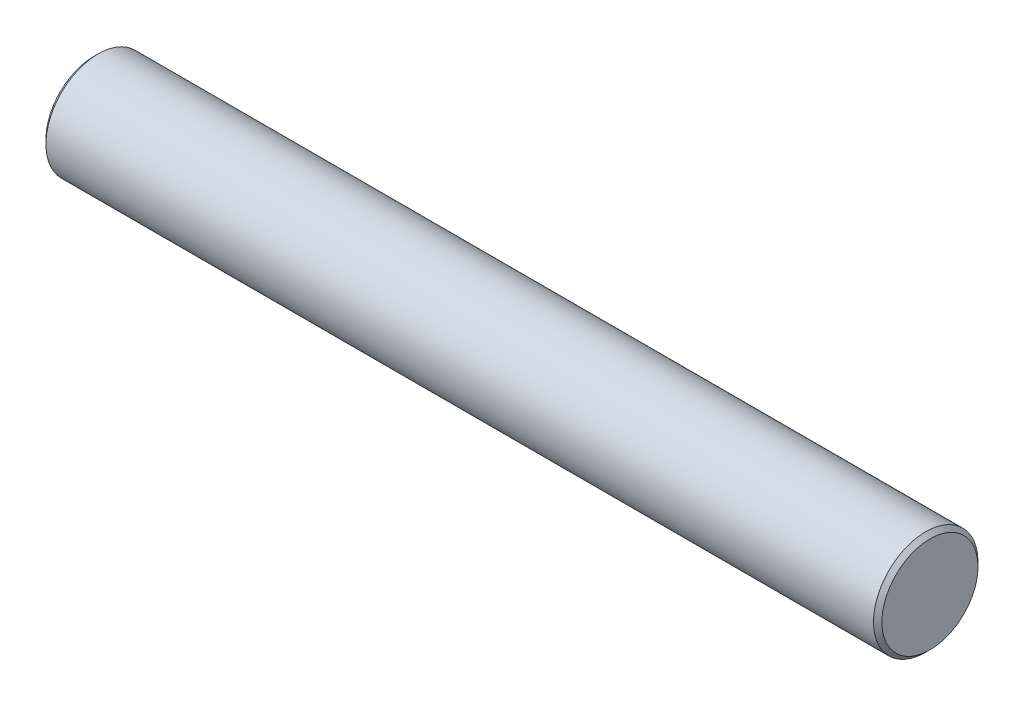
ISO-10303-21;
HEADER;
FILE_DESCRIPTION(('STEP AP214'),'2;1');
FILE_NAME('part.step','',(''),(''),'','','');
FILE_SCHEMA(('AUTOMOTIVE_DESIGN { 1 0 10303 214 1 1 1 1 }'));
ENDSEC;
DATA;
#1=APPLICATION_CONTEXT('core data for automotive mechanical design processes');
#2=APPLICATION_PROTOCOL_DEFINITION('international standard','automotive_design',2000,#1);
#3=PRODUCT_CONTEXT('',#1,'mechanical');
#4=PRODUCT('Part','Part','',(#3));
#5=PRODUCT_RELATED_PRODUCT_CATEGORY('part','',(#4));
#6=PRODUCT_DEFINITION_FORMATION('','',#4);
#7=PRODUCT_DEFINITION_CONTEXT('part definition',#1,'design');
#8=PRODUCT_DEFINITION('design','',#6,#7);
#9=PRODUCT_DEFINITION_SHAPE('','',#8);
#10=(LENGTH_UNIT() NAMED_UNIT(*) SI_UNIT(.MILLI.,.METRE.));
#11=(NAMED_UNIT(*) PLANE_ANGLE_UNIT() SI_UNIT($,.RADIAN.));
#12=(NAMED_UNIT(*) SI_UNIT($,.STERADIAN.) SOLID_ANGLE_UNIT());
#13=UNCERTAINTY_MEASURE_WITH_UNIT(LENGTH_MEASURE(1.E-05),#10,'distance_accuracy_value','');
#14=(GEOMETRIC_REPRESENTATION_CONTEXT(3) GLOBAL_UNCERTAINTY_ASSIGNED_CONTEXT((#13)) GLOBAL_UNIT_ASSIGNED_CONTEXT((#10,
#11,#12)) REPRESENTATION_CONTEXT('',''));
#15=CARTESIAN_POINT('',(0.,0.,0.));
#16=DIRECTION('',(0.,0.,1.));
#17=DIRECTION('',(1.,0.,0.));
#18=AXIS2_PLACEMENT_3D('',#15,#16,#17);
#19=CARTESIAN_POINT('',(-50.8,0.,0.));
#20=DIRECTION('',(1.,0.,0.));
#21=DIRECTION('',(0.,0.,-1.));
#22=AXIS2_PLACEMENT_3D('',#19,#20,#21);
#23=CYLINDRICAL_SURFACE('',#22,3.175);
#24=CARTESIAN_POINT('',(-50.546,0.,0.));
#25=DIRECTION('',(1.,0.,0.));
#26=DIRECTION('',(0.,0.,-1.));
#27=AXIS2_PLACEMENT_3D('',#24,#25,#26);
#28=CIRCLE('',#27,3.175);
#29=CARTESIAN_POINT('',(-50.546,0.,-3.175));
#30=VERTEX_POINT('',#29);
#31=EDGE_CURVE('E40',#30,#30,#28,.T.);
#32=ORIENTED_EDGE('',*,*,#31,.T.);
#33=EDGE_LOOP('',(#32));
#34=FACE_BOUND('',#33,.T.);
#35=CARTESIAN_POINT('',(-0.254000000000004,0.,0.));
#36=DIRECTION('',(1.,0.,0.));
#37=DIRECTION('',(0.,0.,-1.));
#38=AXIS2_PLACEMENT_3D('',#35,#36,#37);
#39=CIRCLE('',#38,3.175);
#40=CARTESIAN_POINT('',(-0.254000000000004,0.,-3.175));
#41=VERTEX_POINT('',#40);
#42=EDGE_CURVE('E44',#41,#41,#39,.F.);
#43=ORIENTED_EDGE('',*,*,#42,.T.);
#44=EDGE_LOOP('',(#43));
#45=FACE_BOUND('',#44,.T.);
#46=ADVANCED_FACE('F29',(#34,#45),#23,.T.);
#47=CARTESIAN_POINT('',(-50.8,0.,0.));
#48=DIRECTION('',(1.,0.,0.));
#49=DIRECTION('',(0.,0.,-1.));
#50=AXIS2_PLACEMENT_3D('',#47,#48,#49);
#51=PLANE('',#50);
#52=CARTESIAN_POINT('',(-50.8,0.,0.));
#53=DIRECTION('',(1.,0.,0.));
#54=DIRECTION('',(0.,0.,-1.));
#55=AXIS2_PLACEMENT_3D('',#52,#53,#54);
#56=CIRCLE('',#55,2.92100000000001);
#57=CARTESIAN_POINT('',(-50.8,0.,-2.92100000000001));
#58=VERTEX_POINT('',#57);
#59=EDGE_CURVE('E36',#58,#58,#56,.F.);
#60=ORIENTED_EDGE('',*,*,#59,.T.);
#61=EDGE_LOOP('',(#60));
#62=FACE_BOUND('',#61,.T.);
#63=ADVANCED_FACE('F60',(#62),#51,.F.);
#64=CARTESIAN_POINT('',(0.,0.,0.));
#65=DIRECTION('',(1.,0.,0.));
#66=DIRECTION('',(0.,0.,-1.));
#67=AXIS2_PLACEMENT_3D('',#64,#65,#66);
#68=PLANE('',#67);
#69=CARTESIAN_POINT('',(0.,0.,0.));
#70=DIRECTION('',(1.,0.,0.));
#71=DIRECTION('',(0.,0.,-1.));
#72=AXIS2_PLACEMENT_3D('',#69,#70,#71);
#73=CIRCLE('',#72,2.921);
#74=CARTESIAN_POINT('',(0.,0.,-2.921));
#75=VERTEX_POINT('',#74);
#76=EDGE_CURVE('E10',#75,#75,#73,.T.);
#77=ORIENTED_EDGE('',*,*,#76,.T.);
#78=EDGE_LOOP('',(#77));
#79=FACE_BOUND('',#78,.T.);
#80=ADVANCED_FACE('F57',(#79),#68,.T.);
#81=CARTESIAN_POINT('',(-50.546,0.,0.));
#82=DIRECTION('',(1.,0.,0.));
#83=DIRECTION('',(0.,0.,-1.));
#84=AXIS2_PLACEMENT_3D('',#81,#82,#83);
#85=CONICAL_SURFACE('',#84,3.175,0.78539816339744);
#86=ORIENTED_EDGE('',*,*,#59,.F.);
#87=EDGE_LOOP('',(#86));
#88=FACE_BOUND('',#87,.T.);
#89=ORIENTED_EDGE('',*,*,#31,.F.);
#90=EDGE_LOOP('',(#89));
#91=FACE_BOUND('',#90,.T.);
#92=ADVANCED_FACE('F53',(#88,#91),#85,.T.);
#93=CARTESIAN_POINT('',(0.,0.,0.));
#94=DIRECTION('',(-1.,0.,0.));
#95=DIRECTION('',(0.,0.,1.));
#96=AXIS2_PLACEMENT_3D('',#93,#94,#95);
#97=CONICAL_SURFACE('',#96,2.921,0.78539816339744);
#98=ORIENTED_EDGE('',*,*,#42,.F.);
#99=EDGE_LOOP('',(#98));
#100=FACE_BOUND('',#99,.T.);
#101=ORIENTED_EDGE('',*,*,#76,.F.);
#102=EDGE_LOOP('',(#101));
#103=FACE_BOUND('',#102,.T.);
#104=ADVANCED_FACE('F31',(#100,#103),#97,.T.);
#105=CLOSED_SHELL('',(#46,#63,#80,#92,#104));
#106=MANIFOLD_SOLID_BREP('B2',#105);
#107=ADVANCED_BREP_SHAPE_REPRESENTATION('',(#18,#106),#14);
#108=SHAPE_DEFINITION_REPRESENTATION(#9,#107);
ENDSEC;
END-ISO-10303-21;
